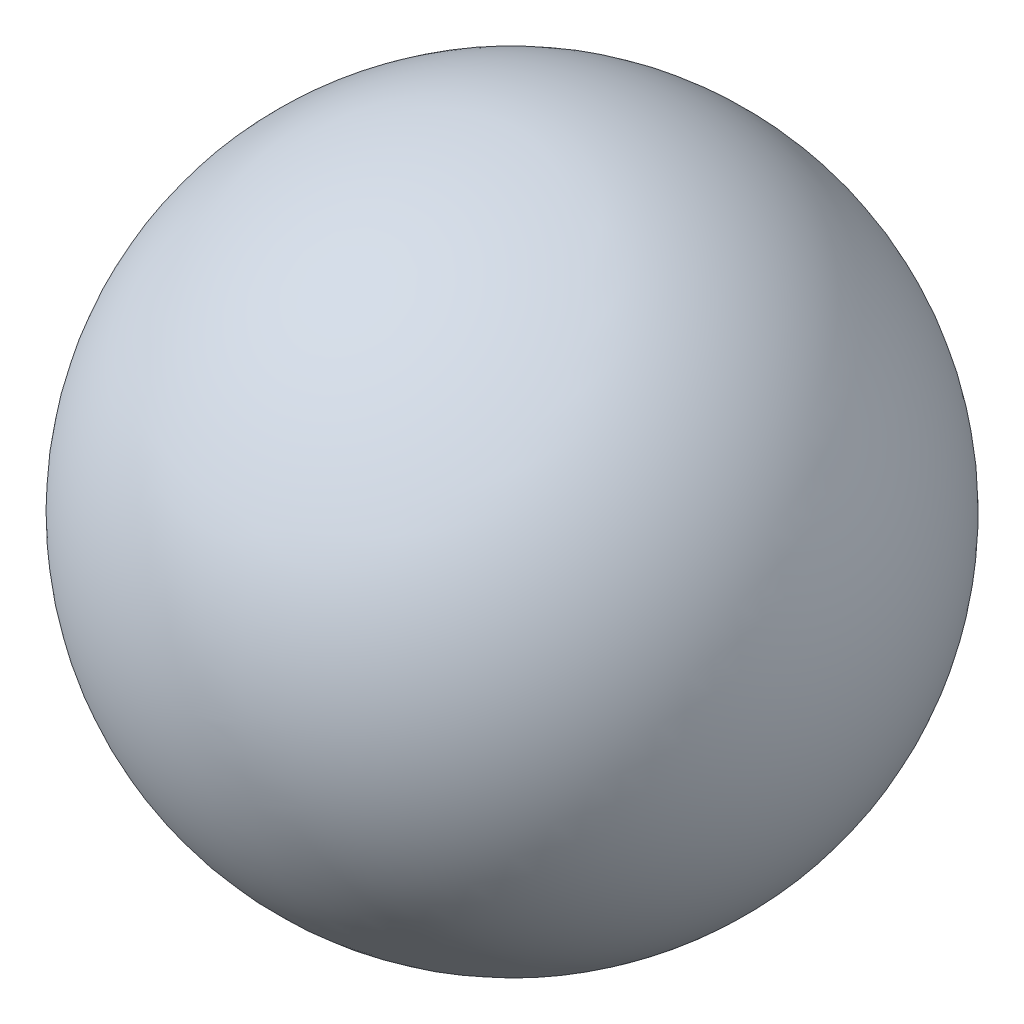
ISO-10303-21;
HEADER;
FILE_DESCRIPTION(('STEP AP214'),'2;1');
FILE_NAME('part.step','',(''),(''),'','','');
FILE_SCHEMA(('AUTOMOTIVE_DESIGN { 1 0 10303 214 1 1 1 1 }'));
ENDSEC;
DATA;
#1=APPLICATION_CONTEXT('core data for automotive mechanical design processes');
#2=APPLICATION_PROTOCOL_DEFINITION('international standard','automotive_design',2000,#1);
#3=PRODUCT_CONTEXT('',#1,'mechanical');
#4=PRODUCT('Part','Part','',(#3));
#5=PRODUCT_RELATED_PRODUCT_CATEGORY('part','',(#4));
#6=PRODUCT_DEFINITION_FORMATION('','',#4);
#7=PRODUCT_DEFINITION_CONTEXT('part definition',#1,'design');
#8=PRODUCT_DEFINITION('design','',#6,#7);
#9=PRODUCT_DEFINITION_SHAPE('','',#8);
#10=(LENGTH_UNIT() NAMED_UNIT(*) SI_UNIT(.MILLI.,.METRE.));
#11=(NAMED_UNIT(*) PLANE_ANGLE_UNIT() SI_UNIT($,.RADIAN.));
#12=(NAMED_UNIT(*) SI_UNIT($,.STERADIAN.) SOLID_ANGLE_UNIT());
#13=UNCERTAINTY_MEASURE_WITH_UNIT(LENGTH_MEASURE(1.E-05),#10,'distance_accuracy_value','');
#14=(GEOMETRIC_REPRESENTATION_CONTEXT(3) GLOBAL_UNCERTAINTY_ASSIGNED_CONTEXT((#13)) GLOBAL_UNIT_ASSIGNED_CONTEXT((#10,
#11,#12)) REPRESENTATION_CONTEXT('',''));
#15=CARTESIAN_POINT('',(0.,0.,0.));
#16=DIRECTION('',(0.,0.,1.));
#17=DIRECTION('',(1.,0.,0.));
#18=AXIS2_PLACEMENT_3D('',#15,#16,#17);
#19=CARTESIAN_POINT('',(64.16,65.1716395731653,23.8045811629913));
#20=DIRECTION('',(0.,0.939302704886864,0.343089534367082));
#21=DIRECTION('',(0.173648177666933,-0.337877233422051,0.925032586197921));
#22=AXIS2_PLACEMENT_3D('',#19,#20,#21);
#23=SPHERICAL_SURFACE('',#22,7.15);
#24=CARTESIAN_POINT('',(64.16,58.4556252332242,21.3514909922667));
#25=VERTEX_POINT('',#24);
#26=VERTEX_LOOP('',#25);
#27=FACE_BOUND('',#26,.T.);
#28=CARTESIAN_POINT('',(64.16,71.8876539131064,26.2576713337159));
#29=VERTEX_POINT('',#28);
#30=VERTEX_LOOP('',#29);
#31=FACE_BOUND('',#30,.T.);
#32=ADVANCED_FACE('F15',(#27,#31),#23,.T.);
#33=CLOSED_SHELL('',(#32));
#34=MANIFOLD_SOLID_BREP('B1',#33);
#35=ADVANCED_BREP_SHAPE_REPRESENTATION('',(#18,#34),#14);
#36=SHAPE_DEFINITION_REPRESENTATION(#9,#35);
ENDSEC;
END-ISO-10303-21;
